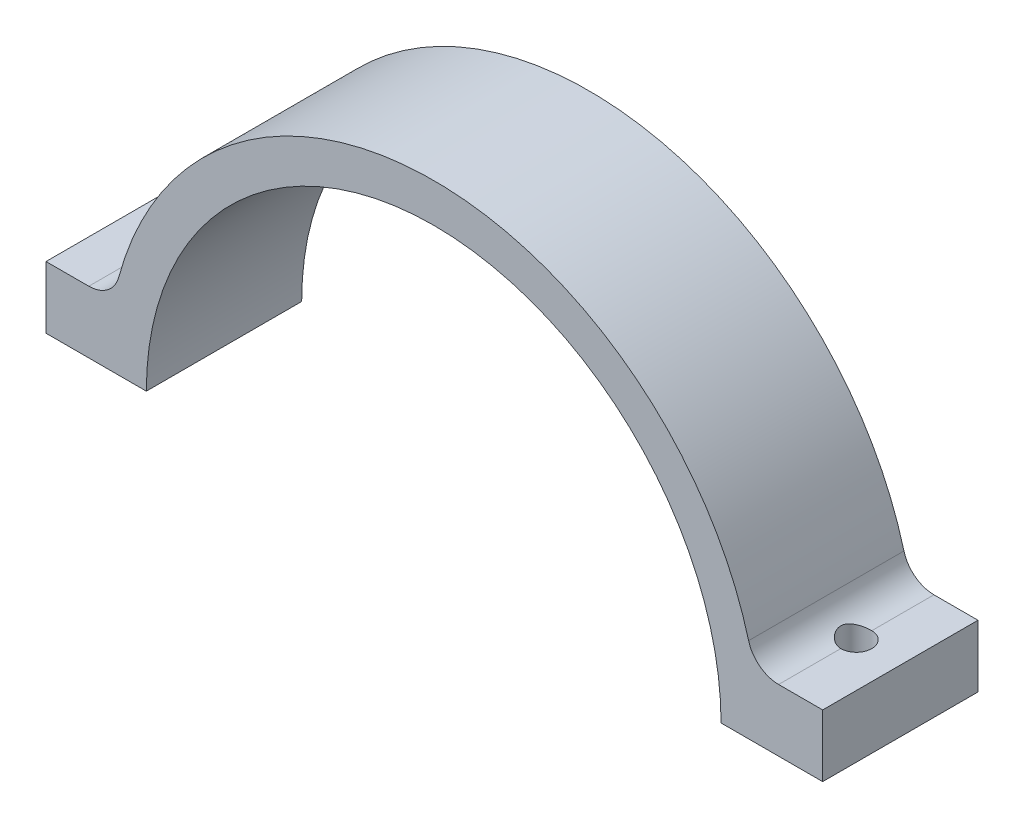
ISO-10303-21;
HEADER;
FILE_DESCRIPTION(('STEP AP214'),'2;1');
FILE_NAME('part.step','',(''),(''),'','','');
FILE_SCHEMA(('AUTOMOTIVE_DESIGN { 1 0 10303 214 1 1 1 1 }'));
ENDSEC;
DATA;
#1=APPLICATION_CONTEXT('core data for automotive mechanical design processes');
#2=APPLICATION_PROTOCOL_DEFINITION('international standard','automotive_design',2000,#1);
#3=PRODUCT_CONTEXT('',#1,'mechanical');
#4=PRODUCT('Part','Part','',(#3));
#5=PRODUCT_RELATED_PRODUCT_CATEGORY('part','',(#4));
#6=PRODUCT_DEFINITION_FORMATION('','',#4);
#7=PRODUCT_DEFINITION_CONTEXT('part definition',#1,'design');
#8=PRODUCT_DEFINITION('design','',#6,#7);
#9=PRODUCT_DEFINITION_SHAPE('','',#8);
#10=(LENGTH_UNIT() NAMED_UNIT(*) SI_UNIT(.MILLI.,.METRE.));
#11=(NAMED_UNIT(*) PLANE_ANGLE_UNIT() SI_UNIT($,.RADIAN.));
#12=(NAMED_UNIT(*) SI_UNIT($,.STERADIAN.) SOLID_ANGLE_UNIT());
#13=UNCERTAINTY_MEASURE_WITH_UNIT(LENGTH_MEASURE(1.E-05),#10,'distance_accuracy_value','');
#14=(GEOMETRIC_REPRESENTATION_CONTEXT(3) GLOBAL_UNCERTAINTY_ASSIGNED_CONTEXT((#13)) GLOBAL_UNIT_ASSIGNED_CONTEXT((#10,
#11,#12)) REPRESENTATION_CONTEXT('',''));
#15=CARTESIAN_POINT('',(0.,0.,0.));
#16=DIRECTION('',(0.,0.,1.));
#17=DIRECTION('',(1.,0.,0.));
#18=AXIS2_PLACEMENT_3D('',#15,#16,#17);
#19=CARTESIAN_POINT('',(0.,0.,25.4));
#20=DIRECTION('',(0.,0.,-1.));
#21=DIRECTION('',(-1.,0.,0.));
#22=AXIS2_PLACEMENT_3D('',#19,#20,#21);
#23=CYLINDRICAL_SURFACE('',#22,53.34);
#24=CARTESIAN_POINT('',(0.,0.,0.));
#25=DIRECTION('',(0.,0.,1.));
#26=DIRECTION('',(1.,0.,0.));
#27=AXIS2_PLACEMENT_3D('',#24,#25,#26);
#28=CIRCLE('',#27,53.34);
#29=CARTESIAN_POINT('',(51.4930522007847,13.9147826086956,0.));
#30=VERTEX_POINT('',#29);
#31=CARTESIAN_POINT('',(-51.4930522007847,13.9147826086956,0.));
#32=VERTEX_POINT('',#31);
#33=EDGE_CURVE('E244',#30,#32,#28,.T.);
#34=ORIENTED_EDGE('',*,*,#33,.T.);
#35=DIRECTION('',(0.,0.,-1.));
#36=VECTOR('',#35,1.);
#37=CARTESIAN_POINT('',(-51.4930522007847,13.9147826086956,25.4));
#38=LINE('',#37,#36);
#39=CARTESIAN_POINT('',(-51.4930522007847,13.9147826086956,25.4));
#40=VERTEX_POINT('',#39);
#41=EDGE_CURVE('E221',#32,#40,#38,.F.);
#42=ORIENTED_EDGE('',*,*,#41,.T.);
#43=CARTESIAN_POINT('',(0.,0.,25.4));
#44=DIRECTION('',(0.,0.,1.));
#45=DIRECTION('',(1.,0.,0.));
#46=AXIS2_PLACEMENT_3D('',#43,#44,#45);
#47=CIRCLE('',#46,53.34);
#48=CARTESIAN_POINT('',(51.4930522007847,13.9147826086956,25.4));
#49=VERTEX_POINT('',#48);
#50=EDGE_CURVE('E239',#49,#40,#47,.T.);
#51=ORIENTED_EDGE('',*,*,#50,.F.);
#52=DIRECTION('',(0.,0.,-1.));
#53=VECTOR('',#52,1.);
#54=CARTESIAN_POINT('',(51.4930522007847,13.9147826086956,25.4));
#55=LINE('',#54,#53);
#56=EDGE_CURVE('E223',#49,#30,#55,.T.);
#57=ORIENTED_EDGE('',*,*,#56,.T.);
#58=EDGE_LOOP('',(#34,#42,#51,#57));
#59=FACE_BOUND('',#58,.T.);
#60=ADVANCED_FACE('F41',(#59),#23,.T.);
#61=CARTESIAN_POINT('',(-53.34,0.,25.4));
#62=DIRECTION('',(0.,1.,0.));
#63=DIRECTION('',(0.,0.,1.));
#64=AXIS2_PLACEMENT_3D('',#61,#62,#63);
#65=PLANE('',#64);
#66=CARTESIAN_POINT('',(-56.3971524103833,0.,12.7));
#67=DIRECTION('',(0.,1.,0.));
#68=DIRECTION('',(-1.,0.,0.));
#69=AXIS2_PLACEMENT_3D('',#66,#67,#68);
#70=CIRCLE('',#69,2.54);
#71=CARTESIAN_POINT('',(-58.9371524103833,0.,12.7));
#72=VERTEX_POINT('',#71);
#73=EDGE_CURVE('E145',#72,#72,#70,.T.);
#74=ORIENTED_EDGE('',*,*,#73,.T.);
#75=EDGE_LOOP('',(#74));
#76=FACE_BOUND('',#75,.T.);
#77=DIRECTION('',(1.,0.,0.));
#78=VECTOR('',#77,1.);
#79=CARTESIAN_POINT('',(-53.34,0.,0.));
#80=LINE('',#79,#78);
#81=CARTESIAN_POINT('',(-63.3976313311813,0.,0.));
#82=VERTEX_POINT('',#81);
#83=CARTESIAN_POINT('',(-46.99,0.,0.));
#84=VERTEX_POINT('',#83);
#85=EDGE_CURVE('E242',#82,#84,#80,.T.);
#86=ORIENTED_EDGE('',*,*,#85,.T.);
#87=DIRECTION('',(0.,0.,-1.));
#88=VECTOR('',#87,1.);
#89=CARTESIAN_POINT('',(-46.99,0.,25.4));
#90=LINE('',#89,#88);
#91=CARTESIAN_POINT('',(-46.99,0.,25.4));
#92=VERTEX_POINT('',#91);
#93=EDGE_CURVE('E228',#92,#84,#90,.T.);
#94=ORIENTED_EDGE('',*,*,#93,.F.);
#95=DIRECTION('',(1.,0.,0.));
#96=VECTOR('',#95,1.);
#97=CARTESIAN_POINT('',(-53.34,0.,25.4));
#98=LINE('',#97,#96);
#99=CARTESIAN_POINT('',(-63.3976313311813,0.,25.4));
#100=VERTEX_POINT('',#99);
#101=EDGE_CURVE('E250',#100,#92,#98,.T.);
#102=ORIENTED_EDGE('',*,*,#101,.F.);
#103=DIRECTION('',(0.,0.,-1.));
#104=VECTOR('',#103,1.);
#105=CARTESIAN_POINT('',(-63.3976313311813,0.,25.4));
#106=LINE('',#105,#104);
#107=EDGE_CURVE('E246',#100,#82,#106,.T.);
#108=ORIENTED_EDGE('',*,*,#107,.T.);
#109=EDGE_LOOP('',(#86,#94,#102,#108));
#110=FACE_BOUND('',#109,.T.);
#111=ADVANCED_FACE('F202',(#76,#110),#65,.F.);
#112=CARTESIAN_POINT('',(0.,0.,25.4));
#113=DIRECTION('',(0.,0.,-1.));
#114=DIRECTION('',(-1.,0.,0.));
#115=AXIS2_PLACEMENT_3D('',#112,#113,#114);
#116=CYLINDRICAL_SURFACE('',#115,46.99);
#117=CARTESIAN_POINT('',(0.,0.,0.));
#118=DIRECTION('',(0.,0.,-1.));
#119=DIRECTION('',(1.,0.,0.));
#120=AXIS2_PLACEMENT_3D('',#117,#118,#119);
#121=CIRCLE('',#120,46.99);
#122=CARTESIAN_POINT('',(46.99,0.,0.));
#123=VERTEX_POINT('',#122);
#124=EDGE_CURVE('E240',#84,#123,#121,.T.);
#125=ORIENTED_EDGE('',*,*,#124,.T.);
#126=DIRECTION('',(0.,0.,-1.));
#127=VECTOR('',#126,1.);
#128=CARTESIAN_POINT('',(46.99,0.,25.4));
#129=LINE('',#128,#127);
#130=CARTESIAN_POINT('',(46.99,0.,25.4));
#131=VERTEX_POINT('',#130);
#132=EDGE_CURVE('E233',#131,#123,#129,.T.);
#133=ORIENTED_EDGE('',*,*,#132,.F.);
#134=CARTESIAN_POINT('',(0.,0.,25.4));
#135=DIRECTION('',(0.,0.,-1.));
#136=DIRECTION('',(1.,0.,0.));
#137=AXIS2_PLACEMENT_3D('',#134,#135,#136);
#138=CIRCLE('',#137,46.99);
#139=EDGE_CURVE('E248',#92,#131,#138,.T.);
#140=ORIENTED_EDGE('',*,*,#139,.F.);
#141=ORIENTED_EDGE('',*,*,#93,.T.);
#142=EDGE_LOOP('',(#125,#133,#140,#141));
#143=FACE_BOUND('',#142,.T.);
#144=ADVANCED_FACE('F198',(#143),#116,.F.);
#145=CARTESIAN_POINT('',(46.99,0.,25.4));
#146=DIRECTION('',(0.,1.,0.));
#147=DIRECTION('',(0.,0.,1.));
#148=AXIS2_PLACEMENT_3D('',#145,#146,#147);
#149=PLANE('',#148);
#150=CARTESIAN_POINT('',(56.3971524103833,0.,12.7000000000001));
#151=DIRECTION('',(0.,1.,0.));
#152=DIRECTION('',(1.,0.,0.));
#153=AXIS2_PLACEMENT_3D('',#150,#151,#152);
#154=CIRCLE('',#153,2.54);
#155=CARTESIAN_POINT('',(58.9371524103833,0.,12.7000000000001));
#156=VERTEX_POINT('',#155);
#157=EDGE_CURVE('E285',#156,#156,#154,.T.);
#158=ORIENTED_EDGE('',*,*,#157,.T.);
#159=EDGE_LOOP('',(#158));
#160=FACE_BOUND('',#159,.T.);
#161=DIRECTION('',(1.,0.,0.));
#162=VECTOR('',#161,1.);
#163=CARTESIAN_POINT('',(46.99,0.,0.));
#164=LINE('',#163,#162);
#165=CARTESIAN_POINT('',(63.6023686688186,0.,0.));
#166=VERTEX_POINT('',#165);
#167=EDGE_CURVE('E237',#123,#166,#164,.T.);
#168=ORIENTED_EDGE('',*,*,#167,.T.);
#169=DIRECTION('',(0.,0.,-1.));
#170=VECTOR('',#169,1.);
#171=CARTESIAN_POINT('',(63.6023686688186,0.,25.4));
#172=LINE('',#171,#170);
#173=CARTESIAN_POINT('',(63.6023686688186,0.,25.4));
#174=VERTEX_POINT('',#173);
#175=EDGE_CURVE('E264',#174,#166,#172,.T.);
#176=ORIENTED_EDGE('',*,*,#175,.F.);
#177=DIRECTION('',(1.,0.,0.));
#178=VECTOR('',#177,1.);
#179=CARTESIAN_POINT('',(46.99,0.,25.4));
#180=LINE('',#179,#178);
#181=EDGE_CURVE('E236',#131,#174,#180,.T.);
#182=ORIENTED_EDGE('',*,*,#181,.F.);
#183=ORIENTED_EDGE('',*,*,#132,.T.);
#184=EDGE_LOOP('',(#168,#176,#182,#183));
#185=FACE_BOUND('',#184,.T.);
#186=ADVANCED_FACE('F191',(#160,#185),#149,.F.);
#187=CARTESIAN_POINT('',(0.,0.,25.4));
#188=DIRECTION('',(0.,0.,1.));
#189=DIRECTION('',(1.,0.,0.));
#190=AXIS2_PLACEMENT_3D('',#187,#188,#189);
#191=PLANE('',#190);
#192=ORIENTED_EDGE('',*,*,#181,.T.);
#193=DIRECTION('',(0.,-1.,0.));
#194=VECTOR('',#193,1.);
#195=CARTESIAN_POINT('',(63.6023686688186,0.,25.4));
#196=LINE('',#195,#194);
#197=CARTESIAN_POINT('',(63.6023686688186,10.16,25.4));
#198=VERTEX_POINT('',#197);
#199=EDGE_CURVE('E272',#198,#174,#196,.T.);
#200=ORIENTED_EDGE('',*,*,#199,.F.);
#201=DIRECTION('',(1.,0.,0.));
#202=VECTOR('',#201,1.);
#203=CARTESIAN_POINT('',(63.6023686688186,10.16,25.4));
#204=LINE('',#203,#202);
#205=CARTESIAN_POINT('',(56.3971524103833,10.16,25.4));
#206=VERTEX_POINT('',#205);
#207=EDGE_CURVE('E278',#206,#198,#204,.T.);
#208=ORIENTED_EDGE('',*,*,#207,.F.);
#209=CARTESIAN_POINT('',(56.3971524103833,15.24,25.4));
#210=DIRECTION('',(0.,0.,1.));
#211=DIRECTION('',(1.,0.,0.));
#212=AXIS2_PLACEMENT_3D('',#209,#210,#211);
#213=CIRCLE('',#212,5.08);
#214=EDGE_CURVE('E138',#206,#49,#213,.F.);
#215=ORIENTED_EDGE('',*,*,#214,.T.);
#216=ORIENTED_EDGE('',*,*,#50,.T.);
#217=CARTESIAN_POINT('',(-56.3971524103833,15.24,25.4));
#218=DIRECTION('',(0.,0.,1.));
#219=DIRECTION('',(1.,0.,0.));
#220=AXIS2_PLACEMENT_3D('',#217,#218,#219);
#221=CIRCLE('',#220,5.08);
#222=CARTESIAN_POINT('',(-56.3971524103833,10.16,25.4));
#223=VERTEX_POINT('',#222);
#224=EDGE_CURVE('E151',#40,#223,#221,.F.);
#225=ORIENTED_EDGE('',*,*,#224,.T.);
#226=DIRECTION('',(1.,0.,0.));
#227=VECTOR('',#226,1.);
#228=CARTESIAN_POINT('',(-63.3976313311813,10.16,25.4));
#229=LINE('',#228,#227);
#230=CARTESIAN_POINT('',(-63.3976313311813,10.16,25.4));
#231=VERTEX_POINT('',#230);
#232=EDGE_CURVE('E255',#231,#223,#229,.T.);
#233=ORIENTED_EDGE('',*,*,#232,.F.);
#234=DIRECTION('',(0.,1.,0.));
#235=VECTOR('',#234,1.);
#236=CARTESIAN_POINT('',(-63.3976313311813,0.,25.4));
#237=LINE('',#236,#235);
#238=EDGE_CURVE('E260',#100,#231,#237,.T.);
#239=ORIENTED_EDGE('',*,*,#238,.F.);
#240=ORIENTED_EDGE('',*,*,#101,.T.);
#241=ORIENTED_EDGE('',*,*,#139,.T.);
#242=EDGE_LOOP('',(#192,#200,#208,#215,#216,#225,#233,#239,#240,#241));
#243=FACE_BOUND('',#242,.T.);
#244=ADVANCED_FACE('F188',(#243),#191,.T.);
#245=CARTESIAN_POINT('',(0.,0.,0.));
#246=DIRECTION('',(0.,0.,1.));
#247=DIRECTION('',(1.,0.,0.));
#248=AXIS2_PLACEMENT_3D('',#245,#246,#247);
#249=PLANE('',#248);
#250=ORIENTED_EDGE('',*,*,#33,.F.);
#251=CARTESIAN_POINT('',(56.3971524103833,15.24,0.));
#252=DIRECTION('',(0.,0.,1.));
#253=DIRECTION('',(1.,0.,0.));
#254=AXIS2_PLACEMENT_3D('',#251,#252,#253);
#255=CIRCLE('',#254,5.08);
#256=CARTESIAN_POINT('',(56.3971524103833,10.16,0.));
#257=VERTEX_POINT('',#256);
#258=EDGE_CURVE('E160',#30,#257,#255,.T.);
#259=ORIENTED_EDGE('',*,*,#258,.T.);
#260=DIRECTION('',(1.,0.,0.));
#261=VECTOR('',#260,1.);
#262=CARTESIAN_POINT('',(63.6023686688186,10.16,0.));
#263=LINE('',#262,#261);
#264=CARTESIAN_POINT('',(63.6023686688186,10.16,0.));
#265=VERTEX_POINT('',#264);
#266=EDGE_CURVE('E279',#257,#265,#263,.T.);
#267=ORIENTED_EDGE('',*,*,#266,.T.);
#268=DIRECTION('',(0.,-1.,0.));
#269=VECTOR('',#268,1.);
#270=CARTESIAN_POINT('',(63.6023686688186,0.,0.));
#271=LINE('',#270,#269);
#272=EDGE_CURVE('E275',#265,#166,#271,.T.);
#273=ORIENTED_EDGE('',*,*,#272,.T.);
#274=ORIENTED_EDGE('',*,*,#167,.F.);
#275=ORIENTED_EDGE('',*,*,#124,.F.);
#276=ORIENTED_EDGE('',*,*,#85,.F.);
#277=DIRECTION('',(0.,1.,0.));
#278=VECTOR('',#277,1.);
#279=CARTESIAN_POINT('',(-63.3976313311813,0.,0.));
#280=LINE('',#279,#278);
#281=CARTESIAN_POINT('',(-63.3976313311813,10.16,0.));
#282=VERTEX_POINT('',#281);
#283=EDGE_CURVE('E261',#82,#282,#280,.T.);
#284=ORIENTED_EDGE('',*,*,#283,.T.);
#285=DIRECTION('',(1.,0.,0.));
#286=VECTOR('',#285,1.);
#287=CARTESIAN_POINT('',(-63.3976313311813,10.16,0.));
#288=LINE('',#287,#286);
#289=CARTESIAN_POINT('',(-56.3971524103833,10.16,0.));
#290=VERTEX_POINT('',#289);
#291=EDGE_CURVE('E258',#282,#290,#288,.T.);
#292=ORIENTED_EDGE('',*,*,#291,.T.);
#293=CARTESIAN_POINT('',(-56.3971524103833,15.24,0.));
#294=DIRECTION('',(0.,0.,1.));
#295=DIRECTION('',(1.,0.,0.));
#296=AXIS2_PLACEMENT_3D('',#293,#294,#295);
#297=CIRCLE('',#296,5.08);
#298=EDGE_CURVE('E158',#290,#32,#297,.T.);
#299=ORIENTED_EDGE('',*,*,#298,.T.);
#300=EDGE_LOOP('',(#250,#259,#267,#273,#274,#275,#276,#284,#292,#299));
#301=FACE_BOUND('',#300,.T.);
#302=ADVANCED_FACE('F183',(#301),#249,.F.);
#303=CARTESIAN_POINT('',(-63.3976313311813,10.16,25.4));
#304=DIRECTION('',(0.,1.,0.));
#305=DIRECTION('',(-1.,0.,0.));
#306=AXIS2_PLACEMENT_3D('',#303,#304,#305);
#307=PLANE('',#306);
#308=CARTESIAN_POINT('',(-56.3971524103833,10.16,12.7));
#309=DIRECTION('',(0.,1.,0.));
#310=DIRECTION('',(-1.,0.,0.));
#311=AXIS2_PLACEMENT_3D('',#308,#309,#310);
#312=CIRCLE('',#311,2.54);
#313=CARTESIAN_POINT('',(-56.3971524103833,10.16,10.16));
#314=VERTEX_POINT('',#313);
#315=CARTESIAN_POINT('',(-56.3971524103833,10.16,15.24));
#316=VERTEX_POINT('',#315);
#317=EDGE_CURVE('E61',#314,#316,#312,.T.);
#318=ORIENTED_EDGE('',*,*,#317,.F.);
#319=DIRECTION('',(0.,0.,-1.));
#320=VECTOR('',#319,1.);
#321=CARTESIAN_POINT('',(-56.3971524103833,10.16,25.4));
#322=LINE('',#321,#320);
#323=EDGE_CURVE('E153',#314,#290,#322,.T.);
#324=ORIENTED_EDGE('',*,*,#323,.T.);
#325=ORIENTED_EDGE('',*,*,#291,.F.);
#326=DIRECTION('',(0.,0.,-1.));
#327=VECTOR('',#326,1.);
#328=CARTESIAN_POINT('',(-63.3976313311813,10.16,25.4));
#329=LINE('',#328,#327);
#330=EDGE_CURVE('E253',#231,#282,#329,.T.);
#331=ORIENTED_EDGE('',*,*,#330,.F.);
#332=ORIENTED_EDGE('',*,*,#232,.T.);
#333=EDGE_CURVE('E149',#223,#316,#322,.T.);
#334=ORIENTED_EDGE('',*,*,#333,.T.);
#335=EDGE_LOOP('',(#318,#324,#325,#331,#332,#334));
#336=FACE_BOUND('',#335,.T.);
#337=ADVANCED_FACE('F180',(#336),#307,.T.);
#338=CARTESIAN_POINT('',(-63.3976313311813,0.,25.4));
#339=DIRECTION('',(-1.,0.,0.));
#340=DIRECTION('',(0.,0.,1.));
#341=AXIS2_PLACEMENT_3D('',#338,#339,#340);
#342=PLANE('',#341);
#343=ORIENTED_EDGE('',*,*,#283,.F.);
#344=ORIENTED_EDGE('',*,*,#107,.F.);
#345=ORIENTED_EDGE('',*,*,#238,.T.);
#346=ORIENTED_EDGE('',*,*,#330,.T.);
#347=EDGE_LOOP('',(#343,#344,#345,#346));
#348=FACE_BOUND('',#347,.T.);
#349=ADVANCED_FACE('F179',(#348),#342,.T.);
#350=CARTESIAN_POINT('',(63.6023686688186,10.16,25.4));
#351=DIRECTION('',(0.,1.,0.));
#352=DIRECTION('',(-1.,0.,0.));
#353=AXIS2_PLACEMENT_3D('',#350,#351,#352);
#354=PLANE('',#353);
#355=CARTESIAN_POINT('',(56.3971524103833,10.16,12.7000000000001));
#356=DIRECTION('',(0.,1.,0.));
#357=DIRECTION('',(-1.,0.,0.));
#358=AXIS2_PLACEMENT_3D('',#355,#356,#357);
#359=CIRCLE('',#358,2.54);
#360=CARTESIAN_POINT('',(56.3971524103833,10.16,15.2400000000001));
#361=VERTEX_POINT('',#360);
#362=CARTESIAN_POINT('',(56.3971524103833,10.16,10.1600000000001));
#363=VERTEX_POINT('',#362);
#364=EDGE_CURVE('E67',#361,#363,#359,.T.);
#365=ORIENTED_EDGE('',*,*,#364,.F.);
#366=DIRECTION('',(0.,0.,-1.));
#367=VECTOR('',#366,1.);
#368=CARTESIAN_POINT('',(56.3971524103833,10.16,25.4));
#369=LINE('',#368,#367);
#370=EDGE_CURVE('E141',#361,#206,#369,.F.);
#371=ORIENTED_EDGE('',*,*,#370,.T.);
#372=ORIENTED_EDGE('',*,*,#207,.T.);
#373=DIRECTION('',(0.,0.,-1.));
#374=VECTOR('',#373,1.);
#375=CARTESIAN_POINT('',(63.6023686688186,10.16,25.4));
#376=LINE('',#375,#374);
#377=EDGE_CURVE('E269',#198,#265,#376,.T.);
#378=ORIENTED_EDGE('',*,*,#377,.T.);
#379=ORIENTED_EDGE('',*,*,#266,.F.);
#380=EDGE_CURVE('E144',#257,#363,#369,.F.);
#381=ORIENTED_EDGE('',*,*,#380,.T.);
#382=EDGE_LOOP('',(#365,#371,#372,#378,#379,#381));
#383=FACE_BOUND('',#382,.T.);
#384=ADVANCED_FACE('F140',(#383),#354,.T.);
#385=CARTESIAN_POINT('',(63.6023686688186,0.,25.4));
#386=DIRECTION('',(1.,0.,0.));
#387=DIRECTION('',(0.,0.,-1.));
#388=AXIS2_PLACEMENT_3D('',#385,#386,#387);
#389=PLANE('',#388);
#390=ORIENTED_EDGE('',*,*,#272,.F.);
#391=ORIENTED_EDGE('',*,*,#377,.F.);
#392=ORIENTED_EDGE('',*,*,#199,.T.);
#393=ORIENTED_EDGE('',*,*,#175,.T.);
#394=EDGE_LOOP('',(#390,#391,#392,#393));
#395=FACE_BOUND('',#394,.T.);
#396=ADVANCED_FACE('F172',(#395),#389,.T.);
#397=CARTESIAN_POINT('',(-56.3971524103833,15.24,25.4));
#398=DIRECTION('',(0.,0.,-1.));
#399=DIRECTION('',(-1.,0.,0.));
#400=AXIS2_PLACEMENT_3D('',#397,#398,#399);
#401=CYLINDRICAL_SURFACE('',#400,5.08);
#402=ORIENTED_EDGE('',*,*,#323,.F.);
#403=CARTESIAN_POINT('',(-56.3971524103833,10.16,10.16));
#404=CARTESIAN_POINT('',(-56.3301019029563,10.1599880986839,10.1599892259291));
#405=CARTESIAN_POINT('',(-56.263059025366,10.161327175364,10.1626546785422));
#406=CARTESIAN_POINT('',(-56.1295210489469,10.1666179954665,10.1732543625242));
#407=CARTESIAN_POINT('',(-56.0630257409914,10.1705686896823,10.1811864780386));
#408=CARTESIAN_POINT('',(-55.931358493895,10.1809700686307,10.202188446898));
#409=CARTESIAN_POINT('',(-55.8661819373074,10.1874093925298,10.2152349563674));
#410=CARTESIAN_POINT('',(-55.737318698944,10.2026161082331,10.2463052235175));
#411=CARTESIAN_POINT('',(-55.6736321097202,10.2113836442431,10.2643292895027));
#412=CARTESIAN_POINT('',(-55.4856030604984,10.2408502156195,10.3255527320953));
#413=CARTESIAN_POINT('',(-55.3640147371393,10.2647363851612,10.3759482950317));
#414=CARTESIAN_POINT('',(-55.1311327329102,10.3188260942209,10.494120626066));
#415=CARTESIAN_POINT('',(-55.0198494924877,10.3490359416301,10.561914764684));
#416=CARTESIAN_POINT('',(-54.8032824414264,10.4151123833023,10.7175766667));
#417=CARTESIAN_POINT('',(-54.698758828204,10.4512095861761,10.8064045492676));
#418=CARTESIAN_POINT('',(-54.5054018553293,10.5242407083938,10.9995357543116));
#419=CARTESIAN_POINT('',(-54.4165788085897,10.5611751598491,11.1038491663128));
#420=CARTESIAN_POINT('',(-54.2502117658616,10.6350070591154,11.3347090214613));
#421=CARTESIAN_POINT('',(-54.1740783639299,10.6716791171636,11.4623527104515));
#422=CARTESIAN_POINT('',(-54.0446837149046,10.7369368338325,11.7306564253917));
#423=CARTESIAN_POINT('',(-53.9914055876121,10.7655284550703,11.8713067513883));
#424=CARTESIAN_POINT('',(-53.912696471005,10.8087699371214,12.153047806663));
#425=CARTESIAN_POINT('',(-53.8857893507507,10.824151954812,12.2936081050728));
#426=CARTESIAN_POINT('',(-53.8560679075419,10.8411799538416,12.578022974893));
#427=CARTESIAN_POINT('',(-53.8532303205085,10.8428391987007,12.7218742305653));
#428=CARTESIAN_POINT('',(-53.8706467894864,10.8328223210855,12.9902878649119));
#429=CARTESIAN_POINT('',(-53.8881800063961,10.8227171827218,13.1150997459146));
#430=CARTESIAN_POINT('',(-53.9411259654625,10.7930633670161,13.3596962504849));
#431=CARTESIAN_POINT('',(-53.9765440165477,10.7735118856993,13.4794793698744));
#432=CARTESIAN_POINT('',(-54.0648989326893,10.7267384274809,13.7140403528955));
#433=CARTESIAN_POINT('',(-54.1182245974252,10.6993484107385,13.8286366721329));
#434=CARTESIAN_POINT('',(-54.240584681688,10.6399744100469,14.0478082222731));
#435=CARTESIAN_POINT('',(-54.3096265892926,10.6079882389259,14.1523786424266));
#436=CARTESIAN_POINT('',(-54.4716617062289,10.5381269525971,14.3624805078435));
#437=CARTESIAN_POINT('',(-54.5665815247908,10.5000192822684,14.4664538643238));
#438=CARTESIAN_POINT('',(-54.7726754682074,10.4254925313009,14.6576627440452));
#439=CARTESIAN_POINT('',(-54.883858312412,10.3890743703684,14.7448892301439));
#440=CARTESIAN_POINT('',(-55.125898854156,10.3199519753101,14.9039620910564));
#441=CARTESIAN_POINT('',(-55.2574350677904,10.2875022803897,14.9748944473306));
#442=CARTESIAN_POINT('',(-55.5325311869971,10.2321650331246,15.0929773571553));
#443=CARTESIAN_POINT('',(-55.6760689292505,10.2092603026483,15.1401706660038));
#444=CARTESIAN_POINT('',(-55.9168343288995,10.1818787333749,15.1960259322436));
#445=CARTESIAN_POINT('',(-56.0119059248673,10.1737290854214,15.2124600001807));
#446=CARTESIAN_POINT('',(-56.2036743599676,10.1627666831828,15.2344675782311));
#447=CARTESIAN_POINT('',(-56.3003724549818,10.1599582637154,15.2400322671062));
#448=CARTESIAN_POINT('',(-56.3971524103833,10.16,15.24));
#449=B_SPLINE_CURVE_WITH_KNOTS('',3,(#403,#404,#405,#406,#407,#408,#409,#410,#411,#412,#413,
#414,#415,#416,#417,#418,#419,#420,#421,#422,#423,#424,#425,#426,#427,#428,#429,#430,#431,#432,
#433,#434,#435,#436,#437,#438,#439,#440,#441,#442,#443,#444,#445,#446,#447,#448),.UNSPECIFIED.,
.F.,.F.,(4,2,2,2,2,2,2,2,2,2,2,2,2,2,2,2,2,2,2,2,2,2,4),(0.,0.201072514075583,0.402064297145507,
0.602149169813905,0.802246438304746,1.20160814756694,1.60137013627539,2.02510982815384,
2.44912682732699,2.90605547329087,3.36264606242674,3.79190283152324,4.22074466101583,
4.59830336214007,4.97597420360785,5.36244095390801,5.74909222494829,6.18475027471086,
6.62064276263713,7.07699390691409,7.5325201687684,7.82227593805794,8.11226676625599),.UNSPECIFIED.);
#450=EDGE_CURVE('E11',#314,#316,#449,.T.);
#451=ORIENTED_EDGE('',*,*,#450,.T.);
#452=ORIENTED_EDGE('',*,*,#333,.F.);
#453=ORIENTED_EDGE('',*,*,#224,.F.);
#454=ORIENTED_EDGE('',*,*,#41,.F.);
#455=ORIENTED_EDGE('',*,*,#298,.F.);
#456=EDGE_LOOP('',(#402,#451,#452,#453,#454,#455));
#457=FACE_BOUND('',#456,.T.);
#458=ADVANCED_FACE('F175',(#457),#401,.F.);
#459=CARTESIAN_POINT('',(56.3971524103833,15.24,25.4));
#460=DIRECTION('',(0.,0.,-1.));
#461=DIRECTION('',(-1.,0.,0.));
#462=AXIS2_PLACEMENT_3D('',#459,#460,#461);
#463=CYLINDRICAL_SURFACE('',#462,5.08);
#464=ORIENTED_EDGE('',*,*,#370,.F.);
#465=CARTESIAN_POINT('',(56.3971524103833,10.16,15.2400000000001));
#466=CARTESIAN_POINT('',(56.3301019029563,10.1599880986839,15.2400107740709));
#467=CARTESIAN_POINT('',(56.263059025366,10.161327175364,15.2373453214579));
#468=CARTESIAN_POINT('',(56.1295210489469,10.1666179954665,15.2267456374758));
#469=CARTESIAN_POINT('',(56.0630257409914,10.1705686896823,15.2188135219615));
#470=CARTESIAN_POINT('',(55.931358493895,10.1809700686307,15.197811553102));
#471=CARTESIAN_POINT('',(55.8661819373074,10.1874093925298,15.1847650436327));
#472=CARTESIAN_POINT('',(55.737318698944,10.2026161082331,15.1536947764826));
#473=CARTESIAN_POINT('',(55.6736321097202,10.2113836442431,15.1356707104974));
#474=CARTESIAN_POINT('',(55.4856030604984,10.2408502156195,15.0744472679047));
#475=CARTESIAN_POINT('',(55.3640147371393,10.2647363851612,15.0240517049684));
#476=CARTESIAN_POINT('',(55.1311327329102,10.3188260942209,14.905879373934));
#477=CARTESIAN_POINT('',(55.0198494924877,10.3490359416301,14.8380852353161));
#478=CARTESIAN_POINT('',(54.8032824414264,10.4151123833023,14.6824233333001));
#479=CARTESIAN_POINT('',(54.698758828204,10.4512095861761,14.5935954507325));
#480=CARTESIAN_POINT('',(54.5054018553293,10.5242407083938,14.4004642456885));
#481=CARTESIAN_POINT('',(54.4165788085897,10.5611751598491,14.2961508336873));
#482=CARTESIAN_POINT('',(54.2502117658616,10.6350070591154,14.0652909785388));
#483=CARTESIAN_POINT('',(54.1740783639299,10.6716791171636,13.9376472895486));
#484=CARTESIAN_POINT('',(54.0446837149046,10.7369368338325,13.6693435746084));
#485=CARTESIAN_POINT('',(53.9914055876121,10.7655284550703,13.5286932486118));
#486=CARTESIAN_POINT('',(53.912696471005,10.8087699371214,13.246952193337));
#487=CARTESIAN_POINT('',(53.8857893507507,10.824151954812,13.1063918949273));
#488=CARTESIAN_POINT('',(53.8560679075419,10.8411799538416,12.8219770251071));
#489=CARTESIAN_POINT('',(53.8532303205085,10.8428391987007,12.6781257694348));
#490=CARTESIAN_POINT('',(53.8706467894864,10.8328223210855,12.4097121350881));
#491=CARTESIAN_POINT('',(53.8881800063961,10.8227171827218,12.2849002540854));
#492=CARTESIAN_POINT('',(53.9411259654625,10.7930633670161,12.0403037495152));
#493=CARTESIAN_POINT('',(53.9765440165477,10.7735118856993,11.9205206301257));
#494=CARTESIAN_POINT('',(54.0648989326893,10.7267384274809,11.6859596471045));
#495=CARTESIAN_POINT('',(54.1182245974252,10.6993484107386,11.5713633278672));
#496=CARTESIAN_POINT('',(54.240584681688,10.6399744100469,11.352191777727));
#497=CARTESIAN_POINT('',(54.3096265892926,10.6079882389259,11.2476213575735));
#498=CARTESIAN_POINT('',(54.4716617062289,10.5381269525971,11.0375194921566));
#499=CARTESIAN_POINT('',(54.5665815247907,10.5000192822684,10.9335461356762));
#500=CARTESIAN_POINT('',(54.7726754682074,10.4254925313009,10.7423372559548));
#501=CARTESIAN_POINT('',(54.883858312412,10.3890743703684,10.6551107698562));
#502=CARTESIAN_POINT('',(55.1258988541559,10.3199519753101,10.4960379089436));
#503=CARTESIAN_POINT('',(55.2574350677904,10.2875022803897,10.4251055526695));
#504=CARTESIAN_POINT('',(55.5325311869971,10.2321650331246,10.3070226428447));
#505=CARTESIAN_POINT('',(55.6760689292504,10.2092603026483,10.2598293339963));
#506=CARTESIAN_POINT('',(55.9168343288995,10.1818787333749,10.2039740677564));
#507=CARTESIAN_POINT('',(56.0119059248673,10.1737290854214,10.1875399998193));
#508=CARTESIAN_POINT('',(56.2036743599676,10.1627666831828,10.165532421769));
#509=CARTESIAN_POINT('',(56.3003724549818,10.1599582637154,10.1599677328939));
#510=CARTESIAN_POINT('',(56.3971524103833,10.16,10.1600000000001));
#511=B_SPLINE_CURVE_WITH_KNOTS('',3,(#465,#466,#467,#468,#469,#470,#471,#472,#473,#474,#475,
#476,#477,#478,#479,#480,#481,#482,#483,#484,#485,#486,#487,#488,#489,#490,#491,#492,#493,#494,
#495,#496,#497,#498,#499,#500,#501,#502,#503,#504,#505,#506,#507,#508,#509,#510),.UNSPECIFIED.,
.F.,.F.,(4,2,2,2,2,2,2,2,2,2,2,2,2,2,2,2,2,2,2,2,2,2,4),(0.,0.20107251407559,0.402064297145521,
0.602149169813919,0.802246438304753,1.20160814756696,1.60137013627539,2.02510982815385,
2.44912682732701,2.90605547329089,3.36264606242674,3.79190283152325,4.22074466101583,
4.59830336214007,4.97597420360786,5.36244095390801,5.7490922249483,6.18475027471087,
6.62064276263714,7.07699390691411,7.53252016876841,7.82227593805796,8.11226676625601),.UNSPECIFIED.);
#512=EDGE_CURVE('E55',#361,#363,#511,.T.);
#513=ORIENTED_EDGE('',*,*,#512,.T.);
#514=ORIENTED_EDGE('',*,*,#380,.F.);
#515=ORIENTED_EDGE('',*,*,#258,.F.);
#516=ORIENTED_EDGE('',*,*,#56,.F.);
#517=ORIENTED_EDGE('',*,*,#214,.F.);
#518=EDGE_LOOP('',(#464,#513,#514,#515,#516,#517));
#519=FACE_BOUND('',#518,.T.);
#520=ADVANCED_FACE('F43',(#519),#463,.F.);
#521=CARTESIAN_POINT('',(56.3971524103833,0.,12.7000000000001));
#522=DIRECTION('',(0.,1.,0.));
#523=DIRECTION('',(-1.,0.,0.));
#524=AXIS2_PLACEMENT_3D('',#521,#522,#523);
#525=CYLINDRICAL_SURFACE('',#524,2.54);
#526=ORIENTED_EDGE('',*,*,#364,.T.);
#527=ORIENTED_EDGE('',*,*,#512,.F.);
#528=EDGE_LOOP('',(#526,#527));
#529=FACE_BOUND('',#528,.T.);
#530=ORIENTED_EDGE('',*,*,#157,.F.);
#531=EDGE_LOOP('',(#530));
#532=FACE_BOUND('',#531,.T.);
#533=ADVANCED_FACE('F132',(#529,#532),#525,.F.);
#534=CARTESIAN_POINT('',(-56.3971524103833,0.,12.7));
#535=DIRECTION('',(0.,1.,0.));
#536=DIRECTION('',(-1.,0.,0.));
#537=AXIS2_PLACEMENT_3D('',#534,#535,#536);
#538=CYLINDRICAL_SURFACE('',#537,2.54);
#539=ORIENTED_EDGE('',*,*,#317,.T.);
#540=ORIENTED_EDGE('',*,*,#450,.F.);
#541=EDGE_LOOP('',(#539,#540));
#542=FACE_BOUND('',#541,.T.);
#543=ORIENTED_EDGE('',*,*,#73,.F.);
#544=EDGE_LOOP('',(#543));
#545=FACE_BOUND('',#544,.T.);
#546=ADVANCED_FACE('F170',(#542,#545),#538,.F.);
#547=CLOSED_SHELL('',(#60,#111,#144,#186,#244,#302,#337,#349,#384,#396,#458,#520,#533,#546));
#548=MANIFOLD_SOLID_BREP('B2',#547);
#549=ADVANCED_BREP_SHAPE_REPRESENTATION('',(#18,#548),#14);
#550=SHAPE_DEFINITION_REPRESENTATION(#9,#549);
ENDSEC;
END-ISO-10303-21;
